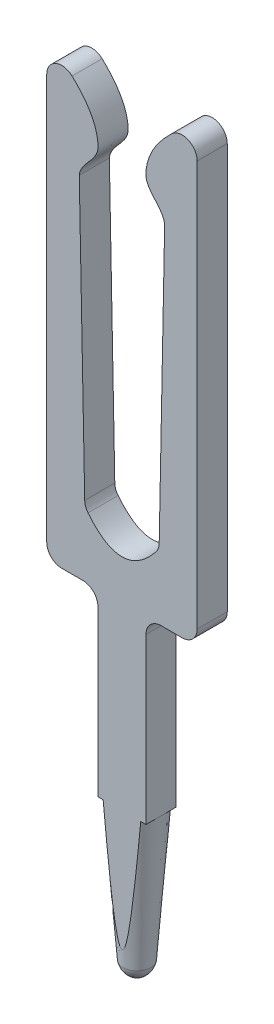
ISO-10303-21;
HEADER;
FILE_DESCRIPTION(('STEP AP214'),'2;1');
FILE_NAME('part.step','',(''),(''),'','','');
FILE_SCHEMA(('AUTOMOTIVE_DESIGN { 1 0 10303 214 1 1 1 1 }'));
ENDSEC;
DATA;
#1=APPLICATION_CONTEXT('core data for automotive mechanical design processes');
#2=APPLICATION_PROTOCOL_DEFINITION('international standard','automotive_design',2000,#1);
#3=PRODUCT_CONTEXT('',#1,'mechanical');
#4=PRODUCT('Part','Part','',(#3));
#5=PRODUCT_RELATED_PRODUCT_CATEGORY('part','',(#4));
#6=PRODUCT_DEFINITION_FORMATION('','',#4);
#7=PRODUCT_DEFINITION_CONTEXT('part definition',#1,'design');
#8=PRODUCT_DEFINITION('design','',#6,#7);
#9=PRODUCT_DEFINITION_SHAPE('','',#8);
#10=(LENGTH_UNIT() NAMED_UNIT(*) SI_UNIT(.MILLI.,.METRE.));
#11=(NAMED_UNIT(*) PLANE_ANGLE_UNIT() SI_UNIT($,.RADIAN.));
#12=(NAMED_UNIT(*) SI_UNIT($,.STERADIAN.) SOLID_ANGLE_UNIT());
#13=UNCERTAINTY_MEASURE_WITH_UNIT(LENGTH_MEASURE(1.E-05),#10,'distance_accuracy_value','');
#14=(GEOMETRIC_REPRESENTATION_CONTEXT(3) GLOBAL_UNCERTAINTY_ASSIGNED_CONTEXT((#13)) GLOBAL_UNIT_ASSIGNED_CONTEXT((#10,
#11,#12)) REPRESENTATION_CONTEXT('',''));
#15=CARTESIAN_POINT('',(0.,0.,0.));
#16=DIRECTION('',(0.,0.,1.));
#17=DIRECTION('',(1.,0.,0.));
#18=AXIS2_PLACEMENT_3D('',#15,#16,#17);
#19=CARTESIAN_POINT('',(0.0155617112013381,0.199393663752104,-0.2));
#20=DIRECTION('',(0.,0.,-1.));
#21=DIRECTION('',(-1.,0.,0.));
#22=AXIS2_PLACEMENT_3D('',#19,#20,#21);
#23=PLANE('',#22);
#24=DIRECTION('',(0.,1.,0.));
#25=VECTOR('',#24,1.);
#26=CARTESIAN_POINT('',(0.319999999997281,1.99939366375255,-0.2));
#27=LINE('',#26,#25);
#28=CARTESIAN_POINT('',(0.319999999997281,1.99939366375255,-0.2));
#29=VERTEX_POINT('',#28);
#30=CARTESIAN_POINT('',(0.3199999999973,4.18939366375255,-0.2));
#31=VERTEX_POINT('',#30);
#32=EDGE_CURVE('E289',#29,#31,#27,.T.);
#33=ORIENTED_EDGE('',*,*,#32,.F.);
#34=DIRECTION('',(-1.,0.,0.));
#35=VECTOR('',#34,1.);
#36=CARTESIAN_POINT('',(0.0155617112013381,1.99939366375255,-0.2));
#37=LINE('',#36,#35);
#38=CARTESIAN_POINT('',(0.249799919932453,1.99939366375255,-0.2));
#39=VERTEX_POINT('',#38);
#40=EDGE_CURVE('E401',#29,#39,#37,.T.);
#41=ORIENTED_EDGE('',*,*,#40,.T.);
#42=CARTESIAN_POINT('',(0.419073671509174,3.92408645516069,-0.2));
#43=CARTESIAN_POINT('',(0.40712800713045,3.78040321989385,-0.2));
#44=CARTESIAN_POINT('',(0.39509787611739,3.63672685641608,-0.2));
#45=CARTESIAN_POINT('',(0.370816830363134,3.34972510878114,-0.2));
#46=CARTESIAN_POINT('',(0.358566486072996,3.20639967630892,-0.2));
#47=CARTESIAN_POINT('',(0.333747204268376,2.91987142692738,-0.2));
#48=CARTESIAN_POINT('',(0.321178481879337,2.77666859142871,-0.2));
#49=CARTESIAN_POINT('',(0.295579302297555,2.49028337647282,-0.2));
#50=CARTESIAN_POINT('',(0.28254877963316,2.34710100282909,-0.2));
#51=CARTESIAN_POINT('',(0.255746692767626,2.06025946856469,-0.2));
#52=CARTESIAN_POINT('',(0.241972513289919,1.91660055184255,-0.2));
#53=CARTESIAN_POINT('',(0.21332051096251,1.62946663380266,-0.2));
#54=CARTESIAN_POINT('',(0.198443274298863,1.48599157543829,-0.2));
#55=CARTESIAN_POINT('',(0.174488103682482,1.27075833578245,-0.2));
#56=CARTESIAN_POINT('',(0.166217295950759,1.19891147184883,-0.2));
#57=CARTESIAN_POINT('',(0.153155496355246,1.09116578699053,-0.2));
#58=CARTESIAN_POINT('',(0.148688714349338,1.05522781017658,-0.2));
#59=CARTESIAN_POINT('',(0.139472101301677,0.983392587569458,-0.2));
#60=CARTESIAN_POINT('',(0.134722305843853,0.947495337231583,-0.2));
#61=CARTESIAN_POINT('',(0.124869569189077,0.875986870674893,-0.2));
#62=CARTESIAN_POINT('',(0.119769129267487,0.840375314140125,-0.2));
#63=CARTESIAN_POINT('',(0.109023940531379,0.769217978597621,-0.2));
#64=CARTESIAN_POINT('',(0.103378950954709,0.733672235832477,-0.2));
#65=CARTESIAN_POINT('',(0.0912261584756975,0.66280969959597,-0.2));
#66=CARTESIAN_POINT('',(0.084720471006859,0.627492560599039,-0.2));
#67=CARTESIAN_POINT('',(0.0701717985850192,0.557194005377,-0.2));
#68=CARTESIAN_POINT('',(0.0621295993725504,0.522212427114086,-0.2));
#69=CARTESIAN_POINT('',(0.0467760714276316,0.470439568704958,-0.2));
#70=CARTESIAN_POINT('',(0.0410923595049108,0.453258443601976,-0.2));
#71=CARTESIAN_POINT('',(0.0317678113762845,0.432730614051041,-0.2));
#72=CARTESIAN_POINT('',(0.0297864914459786,0.42866251065825,-0.2));
#73=CARTESIAN_POINT('',(0.0254404656816286,0.420718452882489,-0.2));
#74=CARTESIAN_POINT('',(0.0230756038515883,0.416842577524543,-0.2));
#75=CARTESIAN_POINT('',(0.0190242656789475,0.411372089797048,-0.2));
#76=CARTESIAN_POINT('',(0.0175825015592171,0.409598933684463,-0.2));
#77=CARTESIAN_POINT('',(0.0144628662287334,0.406276111920947,-0.2));
#78=CARTESIAN_POINT('',(0.012786408962071,0.404725212867752,-0.2));
#79=CARTESIAN_POINT('',(0.0101284893327938,0.402788969097241,-0.2));
#80=CARTESIAN_POINT('',(0.00927338341684285,0.402232411565888,-0.2));
#81=CARTESIAN_POINT('',(0.00749475933934107,0.401239035830602,-0.2));
#82=CARTESIAN_POINT('',(0.00657125356457239,0.400802196013568,-0.2));
#83=CARTESIAN_POINT('',(0.00464972682408425,0.40008322462344,-0.2));
#84=CARTESIAN_POINT('',(0.00365087233094683,0.39980324741838,-0.2));
#85=CARTESIAN_POINT('',(0.00161788992752478,0.39944672378717,-0.2));
#86=CARTESIAN_POINT('',(0.000583835507939093,0.399369777040811,-0.2));
#87=CARTESIAN_POINT('',(-0.00134496519590812,0.399426933555201,-0.2));
#88=CARTESIAN_POINT('',(-0.00224058550054397,0.399535259526285,-0.2));
#89=CARTESIAN_POINT('',(-0.00400090696380697,0.399901298855797,-0.2));
#90=CARTESIAN_POINT('',(-0.00486556903124924,0.400159194471305,-0.2));
#91=CARTESIAN_POINT('',(-0.00686482403314496,0.400919306230725,-0.2));
#92=CARTESIAN_POINT('',(-0.00797801607378553,0.401477011992304,-0.2));
#93=CARTESIAN_POINT('',(-0.0101045188725079,0.402757168379165,-0.2));
#94=CARTESIAN_POINT('',(-0.0111175704332691,0.403480031275694,-0.2));
#95=CARTESIAN_POINT('',(-0.0139133830459782,0.405726780073155,-0.2));
#96=CARTESIAN_POINT('',(-0.0155807703610358,0.407391946426814,-0.2));
#97=CARTESIAN_POINT('',(-0.0186820291032431,0.410925286642285,-0.2));
#98=CARTESIAN_POINT('',(-0.020115058046613,0.412794154340097,-0.2));
#99=CARTESIAN_POINT('',(-0.026352586066885,0.421636912065583,-0.2));
#100=CARTESIAN_POINT('',(-0.0302276290644721,0.429241265774938,-0.2));
#101=CARTESIAN_POINT('',(-0.0371989801361271,0.444788107661347,-0.2));
#102=CARTESIAN_POINT('',(-0.0402898393275208,0.452732536264918,-0.2));
#103=CARTESIAN_POINT('',(-0.0488029533433164,0.47660164451218,-0.2));
#104=CARTESIAN_POINT('',(-0.0535667068825664,0.492768378238746,-0.2));
#105=CARTESIAN_POINT('',(-0.0623134470368626,0.52531407131608,-0.2));
#106=CARTESIAN_POINT('',(-0.0662949805885245,0.541693366489904,-0.2));
#107=CARTESIAN_POINT('',(-0.0737505158343691,0.574526435078122,-0.2));
#108=CARTESIAN_POINT('',(-0.0772258035890998,0.590979906288539,-0.2));
#109=CARTESIAN_POINT('',(-0.0838389035205709,0.623937278303003,-0.2));
#110=CARTESIAN_POINT('',(-0.0869770063299774,0.640441122860909,-0.2));
#111=CARTESIAN_POINT('',(-0.102049532537044,0.72278018582763,-0.2));
#112=CARTESIAN_POINT('',(-0.112300603152623,0.788919708458034,-0.2));
#113=CARTESIAN_POINT('',(-0.13135461914938,0.921430874952234,-0.2));
#114=CARTESIAN_POINT('',(-0.140156603016787,0.987802643333006,-0.2));
#115=CARTESIAN_POINT('',(-0.156879631764283,1.12068310945857,-0.2));
#116=CARTESIAN_POINT('',(-0.164800364523363,1.18719184727427,-0.2));
#117=CARTESIAN_POINT('',(-0.180078981910539,1.3202538247986,-0.2));
#118=CARTESIAN_POINT('',(-0.187437019417306,1.38680704742866,-0.2));
#119=CARTESIAN_POINT('',(-0.205254538586591,1.55245287869218,-0.2));
#120=CARTESIAN_POINT('',(-0.215474723437725,1.65157125328146,-0.2));
#121=CARTESIAN_POINT('',(-0.23535301218604,1.84986455219131,-0.2));
#122=CARTESIAN_POINT('',(-0.245011110635313,1.94903947705058,-0.2));
#123=CARTESIAN_POINT('',(-0.273406067564648,2.24664341284771,-0.2));
#124=CARTESIAN_POINT('',(-0.291561130557218,2.44512780087954,-0.2));
#125=CARTESIAN_POINT('',(-0.327009406118385,2.84211156896891,-0.2));
#126=CARTESIAN_POINT('',(-0.344302878718391,3.0406109261725,-0.2));
#127=CARTESIAN_POINT('',(-0.378338654200096,3.43765003785158,-0.2));
#128=CARTESIAN_POINT('',(-0.395080975905226,3.63618979071395,-0.2));
#129=CARTESIAN_POINT('',(-0.414119776687289,3.86452514202617,-0.2));
#130=CARTESIAN_POINT('',(-0.416598673518151,3.89430563855745,-0.2));
#131=CARTESIAN_POINT('',(-0.419073671509174,3.92408645516069,-0.2));
#132=B_SPLINE_CURVE_WITH_KNOTS('',3,(#42,#43,#44,#45,#46,#47,#48,#49,#50,#51,#52,#53,#54,#55,
#56,#57,#58,#59,#60,#61,#62,#63,#64,#65,#66,#67,#68,#69,#70,#71,#72,#73,#74,#75,#76,#77,#78,#79,
#80,#81,#82,#83,#84,#85,#86,#87,#88,#89,#90,#91,#92,#93,#94,#95,#96,#97,#98,#99,#100,#101,#102,
#103,#104,#105,#106,#107,#108,#109,#110,#111,#112,#113,#114,#115,#116,#117,#118,#119,#120,#121,
#122,#123,#124,#125,#126,#127,#128,#129,#130,#131),.UNSPECIFIED.,.F.,.F.,(4,2,2,2,2,2,2,2,2,2,2,
2,2,2,2,2,2,2,2,2,2,2,2,2,2,2,2,2,2,2,2,2,2,2,2,2,2,2,2,2,2,2,2,2,4),(0.,0.432537071701733,
0.864080860612755,1.29534045243422,1.72666143254115,2.15961302404024,2.59233616332747,
2.80929644105702,2.9179390980667,3.02656812389335,3.13448971305868,3.24245923830052,
3.35016816070605,3.45782214969942,3.51190746769699,3.52547400696589,3.53904607798438,
3.5458913073511,3.55269694209812,3.55575075639856,3.55880401901837,3.56189824743552,
3.56498637031057,3.56767883282506,3.57037458313558,3.57408854250019,3.57781187608443,
3.58484167468291,3.59189621382303,3.61730638147686,3.64288855281723,3.69336733772496,
3.74393902408941,3.7943799103403,3.8447769648626,4.0455035147587,4.24636272074621,
4.44729284197419,4.64816817710812,4.94709671827265,5.24602815625899,5.84396276199637,
6.441715801739,7.0394484052259,7.12909886908129),.UNSPECIFIED.);
#133=CARTESIAN_POINT('',(-0.249799919932453,1.99939366375255,-0.2));
#134=VERTEX_POINT('',#133);
#135=EDGE_CURVE('E348',#39,#134,#132,.T.);
#136=ORIENTED_EDGE('',*,*,#135,.T.);
#137=CARTESIAN_POINT('',(-0.319999999997295,1.99939366375255,-0.2));
#138=VERTEX_POINT('',#137);
#139=EDGE_CURVE('E223',#134,#138,#37,.T.);
#140=ORIENTED_EDGE('',*,*,#139,.T.);
#141=DIRECTION('',(0.,-1.,0.));
#142=VECTOR('',#141,1.);
#143=CARTESIAN_POINT('',(-0.319999999997295,1.99939366375255,-0.2));
#144=LINE('',#143,#142);
#145=CARTESIAN_POINT('',(-0.319999999997299,4.18939366375255,-0.2));
#146=VERTEX_POINT('',#145);
#147=EDGE_CURVE('E214',#146,#138,#144,.T.);
#148=ORIENTED_EDGE('',*,*,#147,.F.);
#149=CARTESIAN_POINT('',(-0.519999999997295,4.18939366375255,-0.2));
#150=DIRECTION('',(0.,0.,-1.));
#151=DIRECTION('',(1.,0.,0.));
#152=AXIS2_PLACEMENT_3D('',#149,#150,#151);
#153=CIRCLE('',#152,0.199999999999995);
#154=CARTESIAN_POINT('',(-0.519999999997295,4.38939366375255,-0.2));
#155=VERTEX_POINT('',#154);
#156=EDGE_CURVE('E204',#155,#146,#153,.T.);
#157=ORIENTED_EDGE('',*,*,#156,.F.);
#158=DIRECTION('',(1.,0.,0.));
#159=VECTOR('',#158,1.);
#160=CARTESIAN_POINT('',(-0.519999999997295,4.38939366375255,-0.2));
#161=LINE('',#160,#159);
#162=CARTESIAN_POINT('',(-0.799999999997302,4.38939366375254,-0.2));
#163=VERTEX_POINT('',#162);
#164=EDGE_CURVE('E187',#163,#155,#161,.T.);
#165=ORIENTED_EDGE('',*,*,#164,.F.);
#166=CARTESIAN_POINT('',(-0.799999999997302,4.58939366375254,-0.2));
#167=DIRECTION('',(0.,0.,1.));
#168=DIRECTION('',(-1.,0.,0.));
#169=AXIS2_PLACEMENT_3D('',#166,#167,#168);
#170=CIRCLE('',#169,0.199999999999997);
#171=CARTESIAN_POINT('',(-0.999999999997299,4.58939366375254,-0.2));
#172=VERTEX_POINT('',#171);
#173=EDGE_CURVE('E202',#172,#163,#170,.T.);
#174=ORIENTED_EDGE('',*,*,#173,.F.);
#175=DIRECTION('',(0.,-1.,0.));
#176=VECTOR('',#175,1.);
#177=CARTESIAN_POINT('',(-0.999999999997301,4.58939366375254,-0.2));
#178=LINE('',#177,#176);
#179=CARTESIAN_POINT('',(-0.999999999997309,9.9798172007234,-0.2));
#180=VERTEX_POINT('',#179);
#181=EDGE_CURVE('E207',#180,#172,#178,.T.);
#182=ORIENTED_EDGE('',*,*,#181,.F.);
#183=CARTESIAN_POINT('',(-0.79999999999731,9.9798172007234,-0.2));
#184=DIRECTION('',(0.,0.,1.));
#185=DIRECTION('',(-1.,0.,0.));
#186=AXIS2_PLACEMENT_3D('',#183,#184,#185);
#187=CIRCLE('',#186,0.199999999999997);
#188=CARTESIAN_POINT('',(-0.663039519004162,10.1255629610258,-0.2));
#189=VERTEX_POINT('',#188);
#190=EDGE_CURVE('E209',#189,#180,#187,.T.);
#191=ORIENTED_EDGE('',*,*,#190,.F.);
#192=CARTESIAN_POINT('',(-0.56766920775558,9.0309634852231,-0.2));
#193=CARTESIAN_POINT('',(-0.548453887561713,9.19860321164783,-0.2));
#194=CARTESIAN_POINT('',(-0.310671132232241,9.31086590512073,-0.2));
#195=CARTESIAN_POINT('',(-0.326177603548476,9.73877355482184,-0.2));
#196=CARTESIAN_POINT('',(-0.487599251440385,9.9606979015953,-0.2));
#197=CARTESIAN_POINT('',(-0.663039519004169,10.1255629610258,-0.2));
#198=B_SPLINE_CURVE_WITH_KNOTS('',3,(#192,#193,#194,#195,#196,#197),.UNSPECIFIED.,.F.,.F.,(4,1,
1,4),(0.253308427317744,0.546240991694777,0.590136450844154,1.),.UNSPECIFIED.);
#199=CARTESIAN_POINT('',(-0.56766920775558,9.0309634852231,-0.2));
#200=VERTEX_POINT('',#199);
#201=EDGE_CURVE('E504',#200,#189,#198,.T.);
#202=ORIENTED_EDGE('',*,*,#201,.F.);
#203=DIRECTION('',(-0.0195430550508509,0.999809016262246,0.));
#204=VECTOR('',#203,1.);
#205=CARTESIAN_POINT('',(-0.567669207755583,9.0309634852231,-0.2));
#206=LINE('',#205,#204);
#207=CARTESIAN_POINT('',(-0.495215905001463,5.32430323363701,-0.2));
#208=VERTEX_POINT('',#207);
#209=EDGE_CURVE('E505',#208,#200,#206,.T.);
#210=ORIENTED_EDGE('',*,*,#209,.F.);
#211=CARTESIAN_POINT('',(-0.295254101749013,5.32821184464718,-0.2));
#212=DIRECTION('',(0.,0.,-1.));
#213=DIRECTION('',(1.,0.,0.));
#214=AXIS2_PLACEMENT_3D('',#211,#212,#213);
#215=CIRCLE('',#214,0.199999999999999);
#216=CARTESIAN_POINT('',(-0.45105383851106,5.20280673300943,-0.2));
#217=VERTEX_POINT('',#216);
#218=EDGE_CURVE('E540',#217,#208,#215,.T.);
#219=ORIENTED_EDGE('',*,*,#218,.F.);
#220=CARTESIAN_POINT('',(0.451053838511066,5.20280673300943,-0.2));
#221=CARTESIAN_POINT('',(0.,4.64243029868569,-0.2));
#222=CARTESIAN_POINT('',(-0.451053838511059,5.20280673300943,-0.2));
#223=B_SPLINE_CURVE_WITH_KNOTS('',2,(#220,#221,#222),.UNSPECIFIED.,.F.,.F.,(3,3),
(0.0434047342329982,0.956595265767001),.UNSPECIFIED.);
#224=CARTESIAN_POINT('',(0.451053838511066,5.20280673300943,-0.2));
#225=VERTEX_POINT('',#224);
#226=EDGE_CURVE('E535',#225,#217,#223,.T.);
#227=ORIENTED_EDGE('',*,*,#226,.F.);
#228=CARTESIAN_POINT('',(0.295254101749014,5.32821184464718,-0.2));
#229=DIRECTION('',(0.,0.,-1.));
#230=DIRECTION('',(-1.,0.,0.));
#231=AXIS2_PLACEMENT_3D('',#228,#229,#230);
#232=CIRCLE('',#231,0.200000000000008);
#233=CARTESIAN_POINT('',(0.495215905001471,5.32430323363701,-0.2));
#234=VERTEX_POINT('',#233);
#235=EDGE_CURVE('E541',#234,#225,#232,.T.);
#236=ORIENTED_EDGE('',*,*,#235,.F.);
#237=DIRECTION('',(-0.0195430550508509,-0.999809016262246,0.));
#238=VECTOR('',#237,1.);
#239=CARTESIAN_POINT('',(0.56766920775559,9.0309634852231,-0.2));
#240=LINE('',#239,#238);
#241=CARTESIAN_POINT('',(0.56766920775559,9.0309634852231,-0.2));
#242=VERTEX_POINT('',#241);
#243=EDGE_CURVE('E433',#242,#234,#240,.T.);
#244=ORIENTED_EDGE('',*,*,#243,.F.);
#245=CARTESIAN_POINT('',(0.663039519004167,10.1255629610258,-0.2));
#246=CARTESIAN_POINT('',(0.487599251440384,9.9606979015953,-0.2));
#247=CARTESIAN_POINT('',(0.326177603548475,9.73877355482184,-0.2));
#248=CARTESIAN_POINT('',(0.310671132232241,9.31086590512075,-0.2));
#249=CARTESIAN_POINT('',(0.548453887561712,9.19860321164784,-0.2));
#250=CARTESIAN_POINT('',(0.56766920775558,9.0309634852231,-0.2));
#251=B_SPLINE_CURVE_WITH_KNOTS('',3,(#245,#246,#247,#248,#249,#250),.UNSPECIFIED.,.F.,.F.,(4,1,
1,4),(0.253308427317744,0.66317197647359,0.707067435622967,1.),.UNSPECIFIED.);
#252=CARTESIAN_POINT('',(0.663039519004167,10.1255629610258,-0.2));
#253=VERTEX_POINT('',#252);
#254=EDGE_CURVE('E427',#253,#242,#251,.T.);
#255=ORIENTED_EDGE('',*,*,#254,.F.);
#256=CARTESIAN_POINT('',(0.799999999997309,9.9798172007234,-0.2));
#257=DIRECTION('',(0.,0.,1.));
#258=DIRECTION('',(1.,0.,0.));
#259=AXIS2_PLACEMENT_3D('',#256,#257,#258);
#260=CIRCLE('',#259,0.199999999999997);
#261=CARTESIAN_POINT('',(0.999999999997306,9.9798172007234,-0.2));
#262=VERTEX_POINT('',#261);
#263=EDGE_CURVE('E424',#262,#253,#260,.T.);
#264=ORIENTED_EDGE('',*,*,#263,.F.);
#265=DIRECTION('',(0.,1.,0.));
#266=VECTOR('',#265,1.);
#267=CARTESIAN_POINT('',(0.999999999997302,4.58939366375254,-0.2));
#268=LINE('',#267,#266);
#269=CARTESIAN_POINT('',(0.999999999997302,4.58939366375254,-0.2));
#270=VERTEX_POINT('',#269);
#271=EDGE_CURVE('E421',#270,#262,#268,.T.);
#272=ORIENTED_EDGE('',*,*,#271,.F.);
#273=CARTESIAN_POINT('',(0.799999999997303,4.58939366375254,-0.2));
#274=DIRECTION('',(0.,0.,1.));
#275=DIRECTION('',(1.,0.,0.));
#276=AXIS2_PLACEMENT_3D('',#273,#274,#275);
#277=CIRCLE('',#276,0.199999999999997);
#278=CARTESIAN_POINT('',(0.799999999997303,4.38939366375254,-0.2));
#279=VERTEX_POINT('',#278);
#280=EDGE_CURVE('E418',#279,#270,#277,.T.);
#281=ORIENTED_EDGE('',*,*,#280,.F.);
#282=DIRECTION('',(1.,0.,0.));
#283=VECTOR('',#282,1.);
#284=CARTESIAN_POINT('',(0.519999999997295,4.38939366375255,-0.2));
#285=LINE('',#284,#283);
#286=CARTESIAN_POINT('',(0.519999999997295,4.38939366375255,-0.2));
#287=VERTEX_POINT('',#286);
#288=EDGE_CURVE('E415',#287,#279,#285,.T.);
#289=ORIENTED_EDGE('',*,*,#288,.F.);
#290=CARTESIAN_POINT('',(0.519999999997295,4.18939366375255,-0.2));
#291=DIRECTION('',(0.,0.,-1.));
#292=DIRECTION('',(-1.,0.,0.));
#293=AXIS2_PLACEMENT_3D('',#290,#291,#292);
#294=CIRCLE('',#293,0.199999999999995);
#295=EDGE_CURVE('E413',#31,#287,#294,.T.);
#296=ORIENTED_EDGE('',*,*,#295,.F.);
#297=EDGE_LOOP('',(#33,#41,#136,#140,#148,#157,#165,#174,#182,#191,#202,#210,#219,#227,#236,
#244,#255,#264,#272,#281,#289,#296));
#298=FACE_BOUND('',#297,.T.);
#299=ADVANCED_FACE('F39',(#298),#23,.T.);
#300=CARTESIAN_POINT('',(0.0155617112013381,0.199393663752104,0.2));
#301=DIRECTION('',(0.,0.,-1.));
#302=DIRECTION('',(-1.,0.,0.));
#303=AXIS2_PLACEMENT_3D('',#300,#301,#302);
#304=PLANE('',#303);
#305=DIRECTION('',(-1.,0.,0.));
#306=VECTOR('',#305,1.);
#307=CARTESIAN_POINT('',(0.0155617112013381,1.99939366375255,0.2));
#308=LINE('',#307,#306);
#309=CARTESIAN_POINT('',(0.31999999999729,1.99939366375255,0.2));
#310=VERTEX_POINT('',#309);
#311=CARTESIAN_POINT('',(0.249799919932453,1.99939366375255,0.2));
#312=VERTEX_POINT('',#311);
#313=EDGE_CURVE('E11',#310,#312,#308,.T.);
#314=ORIENTED_EDGE('',*,*,#313,.F.);
#315=DIRECTION('',(0.,1.,0.));
#316=VECTOR('',#315,1.);
#317=CARTESIAN_POINT('',(0.319999999997281,1.99939366375255,0.2));
#318=LINE('',#317,#316);
#319=CARTESIAN_POINT('',(0.3199999999973,4.18939366375255,0.2));
#320=VERTEX_POINT('',#319);
#321=EDGE_CURVE('E218',#310,#320,#318,.T.);
#322=ORIENTED_EDGE('',*,*,#321,.T.);
#323=CARTESIAN_POINT('',(0.519999999997295,4.18939366375255,0.2));
#324=DIRECTION('',(0.,0.,-1.));
#325=DIRECTION('',(-1.,0.,0.));
#326=AXIS2_PLACEMENT_3D('',#323,#324,#325);
#327=CIRCLE('',#326,0.199999999999995);
#328=CARTESIAN_POINT('',(0.519999999997295,4.38939366375255,0.2));
#329=VERTEX_POINT('',#328);
#330=EDGE_CURVE('E222',#320,#329,#327,.T.);
#331=ORIENTED_EDGE('',*,*,#330,.T.);
#332=DIRECTION('',(1.,0.,0.));
#333=VECTOR('',#332,1.);
#334=CARTESIAN_POINT('',(0.519999999997295,4.38939366375255,0.2));
#335=LINE('',#334,#333);
#336=CARTESIAN_POINT('',(0.799999999997303,4.38939366375254,0.2));
#337=VERTEX_POINT('',#336);
#338=EDGE_CURVE('E226',#329,#337,#335,.T.);
#339=ORIENTED_EDGE('',*,*,#338,.T.);
#340=CARTESIAN_POINT('',(0.799999999997303,4.58939366375254,0.2));
#341=DIRECTION('',(0.,0.,1.));
#342=DIRECTION('',(1.,0.,0.));
#343=AXIS2_PLACEMENT_3D('',#340,#341,#342);
#344=CIRCLE('',#343,0.199999999999997);
#345=CARTESIAN_POINT('',(0.999999999997302,4.58939366375254,0.2));
#346=VERTEX_POINT('',#345);
#347=EDGE_CURVE('E229',#337,#346,#344,.T.);
#348=ORIENTED_EDGE('',*,*,#347,.T.);
#349=DIRECTION('',(0.,1.,0.));
#350=VECTOR('',#349,1.);
#351=CARTESIAN_POINT('',(0.999999999997302,4.58939366375254,0.2));
#352=LINE('',#351,#350);
#353=CARTESIAN_POINT('',(0.999999999997306,9.9798172007234,0.2));
#354=VERTEX_POINT('',#353);
#355=EDGE_CURVE('E232',#346,#354,#352,.T.);
#356=ORIENTED_EDGE('',*,*,#355,.T.);
#357=CARTESIAN_POINT('',(0.799999999997309,9.9798172007234,0.2));
#358=DIRECTION('',(0.,0.,1.));
#359=DIRECTION('',(1.,0.,0.));
#360=AXIS2_PLACEMENT_3D('',#357,#358,#359);
#361=CIRCLE('',#360,0.199999999999997);
#362=CARTESIAN_POINT('',(0.663039519004167,10.1255629610258,0.2));
#363=VERTEX_POINT('',#362);
#364=EDGE_CURVE('E235',#354,#363,#361,.T.);
#365=ORIENTED_EDGE('',*,*,#364,.T.);
#366=CARTESIAN_POINT('',(0.663039519004167,10.1255629610258,0.2));
#367=CARTESIAN_POINT('',(0.487599251440384,9.9606979015953,0.2));
#368=CARTESIAN_POINT('',(0.326177603548475,9.73877355482184,0.2));
#369=CARTESIAN_POINT('',(0.310671132232241,9.31086590512075,0.2));
#370=CARTESIAN_POINT('',(0.548453887561712,9.19860321164784,0.2));
#371=CARTESIAN_POINT('',(0.56766920775558,9.0309634852231,0.2));
#372=B_SPLINE_CURVE_WITH_KNOTS('',3,(#366,#367,#368,#369,#370,#371),.UNSPECIFIED.,.F.,.F.,(4,1,
1,4),(0.253308427317744,0.66317197647359,0.707067435622967,1.),.UNSPECIFIED.);
#373=CARTESIAN_POINT('',(0.56766920775559,9.0309634852231,0.2));
#374=VERTEX_POINT('',#373);
#375=EDGE_CURVE('E238',#363,#374,#372,.T.);
#376=ORIENTED_EDGE('',*,*,#375,.T.);
#377=DIRECTION('',(-0.0195430550508509,-0.999809016262246,0.));
#378=VECTOR('',#377,1.);
#379=CARTESIAN_POINT('',(0.56766920775559,9.0309634852231,0.2));
#380=LINE('',#379,#378);
#381=CARTESIAN_POINT('',(0.495215905001471,5.32430323363701,0.2));
#382=VERTEX_POINT('',#381);
#383=EDGE_CURVE('E243',#374,#382,#380,.T.);
#384=ORIENTED_EDGE('',*,*,#383,.T.);
#385=CARTESIAN_POINT('',(0.295254101749014,5.32821184464718,0.2));
#386=DIRECTION('',(0.,0.,-1.));
#387=DIRECTION('',(-1.,0.,0.));
#388=AXIS2_PLACEMENT_3D('',#385,#386,#387);
#389=CIRCLE('',#388,0.200000000000008);
#390=CARTESIAN_POINT('',(0.451053838511066,5.20280673300943,0.2));
#391=VERTEX_POINT('',#390);
#392=EDGE_CURVE('E249',#382,#391,#389,.T.);
#393=ORIENTED_EDGE('',*,*,#392,.T.);
#394=CARTESIAN_POINT('',(0.451053838511066,5.20280673300943,0.2));
#395=CARTESIAN_POINT('',(0.,4.64243029868569,0.2));
#396=CARTESIAN_POINT('',(-0.451053838511059,5.20280673300943,0.2));
#397=B_SPLINE_CURVE_WITH_KNOTS('',2,(#394,#395,#396),.UNSPECIFIED.,.F.,.F.,(3,3),
(0.0434047342329982,0.956595265767001),.UNSPECIFIED.);
#398=CARTESIAN_POINT('',(-0.45105383851106,5.20280673300943,0.2));
#399=VERTEX_POINT('',#398);
#400=EDGE_CURVE('E252',#391,#399,#397,.T.);
#401=ORIENTED_EDGE('',*,*,#400,.T.);
#402=CARTESIAN_POINT('',(-0.295254101749013,5.32821184464718,0.2));
#403=DIRECTION('',(0.,0.,-1.));
#404=DIRECTION('',(1.,0.,0.));
#405=AXIS2_PLACEMENT_3D('',#402,#403,#404);
#406=CIRCLE('',#405,0.199999999999999);
#407=CARTESIAN_POINT('',(-0.495215905001463,5.32430323363701,0.2));
#408=VERTEX_POINT('',#407);
#409=EDGE_CURVE('E257',#399,#408,#406,.T.);
#410=ORIENTED_EDGE('',*,*,#409,.T.);
#411=DIRECTION('',(-0.0195430550508509,0.999809016262246,0.));
#412=VECTOR('',#411,1.);
#413=CARTESIAN_POINT('',(-0.567669207755583,9.0309634852231,0.2));
#414=LINE('',#413,#412);
#415=CARTESIAN_POINT('',(-0.56766920775558,9.0309634852231,0.2));
#416=VERTEX_POINT('',#415);
#417=EDGE_CURVE('E263',#408,#416,#414,.T.);
#418=ORIENTED_EDGE('',*,*,#417,.T.);
#419=CARTESIAN_POINT('',(-0.56766920775558,9.0309634852231,0.2));
#420=CARTESIAN_POINT('',(-0.548453887561713,9.19860321164783,0.2));
#421=CARTESIAN_POINT('',(-0.310671132232241,9.31086590512073,0.2));
#422=CARTESIAN_POINT('',(-0.326177603548476,9.73877355482184,0.2));
#423=CARTESIAN_POINT('',(-0.487599251440385,9.9606979015953,0.2));
#424=CARTESIAN_POINT('',(-0.663039519004169,10.1255629610258,0.2));
#425=B_SPLINE_CURVE_WITH_KNOTS('',3,(#419,#420,#421,#422,#423,#424),.UNSPECIFIED.,.F.,.F.,(4,1,
1,4),(0.253308427317744,0.546240991694777,0.590136450844154,1.),.UNSPECIFIED.);
#426=CARTESIAN_POINT('',(-0.663039519004162,10.1255629610258,0.2));
#427=VERTEX_POINT('',#426);
#428=EDGE_CURVE('E266',#416,#427,#425,.T.);
#429=ORIENTED_EDGE('',*,*,#428,.T.);
#430=CARTESIAN_POINT('',(-0.79999999999731,9.9798172007234,0.2));
#431=DIRECTION('',(0.,0.,1.));
#432=DIRECTION('',(-1.,0.,0.));
#433=AXIS2_PLACEMENT_3D('',#430,#431,#432);
#434=CIRCLE('',#433,0.199999999999997);
#435=CARTESIAN_POINT('',(-0.999999999997309,9.9798172007234,0.2));
#436=VERTEX_POINT('',#435);
#437=EDGE_CURVE('E271',#427,#436,#434,.T.);
#438=ORIENTED_EDGE('',*,*,#437,.T.);
#439=DIRECTION('',(0.,-1.,0.));
#440=VECTOR('',#439,1.);
#441=CARTESIAN_POINT('',(-0.999999999997301,4.58939366375254,0.2));
#442=LINE('',#441,#440);
#443=CARTESIAN_POINT('',(-0.999999999997299,4.58939366375254,0.2));
#444=VERTEX_POINT('',#443);
#445=EDGE_CURVE('E277',#436,#444,#442,.T.);
#446=ORIENTED_EDGE('',*,*,#445,.T.);
#447=CARTESIAN_POINT('',(-0.799999999997302,4.58939366375254,0.2));
#448=DIRECTION('',(0.,0.,1.));
#449=DIRECTION('',(-1.,0.,0.));
#450=AXIS2_PLACEMENT_3D('',#447,#448,#449);
#451=CIRCLE('',#450,0.199999999999997);
#452=CARTESIAN_POINT('',(-0.799999999997302,4.38939366375254,0.2));
#453=VERTEX_POINT('',#452);
#454=EDGE_CURVE('E280',#444,#453,#451,.T.);
#455=ORIENTED_EDGE('',*,*,#454,.T.);
#456=DIRECTION('',(1.,0.,0.));
#457=VECTOR('',#456,1.);
#458=CARTESIAN_POINT('',(-0.519999999997295,4.38939366375255,0.2));
#459=LINE('',#458,#457);
#460=CARTESIAN_POINT('',(-0.519999999997295,4.38939366375255,0.2));
#461=VERTEX_POINT('',#460);
#462=EDGE_CURVE('E189',#453,#461,#459,.T.);
#463=ORIENTED_EDGE('',*,*,#462,.T.);
#464=CARTESIAN_POINT('',(-0.519999999997295,4.18939366375255,0.2));
#465=DIRECTION('',(0.,0.,-1.));
#466=DIRECTION('',(1.,0.,0.));
#467=AXIS2_PLACEMENT_3D('',#464,#465,#466);
#468=CIRCLE('',#467,0.199999999999995);
#469=CARTESIAN_POINT('',(-0.319999999997299,4.18939366375255,0.2));
#470=VERTEX_POINT('',#469);
#471=EDGE_CURVE('E283',#461,#470,#468,.T.);
#472=ORIENTED_EDGE('',*,*,#471,.T.);
#473=DIRECTION('',(0.,-1.,0.));
#474=VECTOR('',#473,1.);
#475=CARTESIAN_POINT('',(-0.319999999997295,1.99939366375255,0.2));
#476=LINE('',#475,#474);
#477=CARTESIAN_POINT('',(-0.319999999997295,1.99939366375255,0.2));
#478=VERTEX_POINT('',#477);
#479=EDGE_CURVE('E286',#470,#478,#476,.T.);
#480=ORIENTED_EDGE('',*,*,#479,.T.);
#481=CARTESIAN_POINT('',(-0.249799919932453,1.99939366375255,0.2));
#482=VERTEX_POINT('',#481);
#483=EDGE_CURVE('E43',#482,#478,#308,.T.);
#484=ORIENTED_EDGE('',*,*,#483,.F.);
#485=CARTESIAN_POINT('',(0.419073671509174,3.92408645516069,0.2));
#486=CARTESIAN_POINT('',(0.40712800713045,3.78040321989385,0.2));
#487=CARTESIAN_POINT('',(0.39509787611739,3.63672685641608,0.2));
#488=CARTESIAN_POINT('',(0.370816830363134,3.34972510878114,0.2));
#489=CARTESIAN_POINT('',(0.358566486072996,3.20639967630892,0.2));
#490=CARTESIAN_POINT('',(0.333747204268376,2.91987142692738,0.2));
#491=CARTESIAN_POINT('',(0.321178481879337,2.77666859142871,0.2));
#492=CARTESIAN_POINT('',(0.295579302297555,2.49028337647282,0.2));
#493=CARTESIAN_POINT('',(0.28254877963316,2.34710100282909,0.2));
#494=CARTESIAN_POINT('',(0.255746692767626,2.06025946856469,0.2));
#495=CARTESIAN_POINT('',(0.241972513289919,1.91660055184255,0.2));
#496=CARTESIAN_POINT('',(0.21332051096251,1.62946663380266,0.2));
#497=CARTESIAN_POINT('',(0.198443274298863,1.48599157543829,0.2));
#498=CARTESIAN_POINT('',(0.174488103682482,1.27075833578245,0.2));
#499=CARTESIAN_POINT('',(0.166217295950759,1.19891147184883,0.2));
#500=CARTESIAN_POINT('',(0.153155496355246,1.09116578699053,0.2));
#501=CARTESIAN_POINT('',(0.148688714349338,1.05522781017658,0.2));
#502=CARTESIAN_POINT('',(0.139472101301677,0.983392587569458,0.2));
#503=CARTESIAN_POINT('',(0.134722305843853,0.947495337231583,0.2));
#504=CARTESIAN_POINT('',(0.124869569189077,0.875986870674893,0.2));
#505=CARTESIAN_POINT('',(0.119769129267487,0.840375314140125,0.2));
#506=CARTESIAN_POINT('',(0.109023940531379,0.769217978597621,0.2));
#507=CARTESIAN_POINT('',(0.103378950954709,0.733672235832477,0.2));
#508=CARTESIAN_POINT('',(0.0912261584756975,0.66280969959597,0.2));
#509=CARTESIAN_POINT('',(0.084720471006859,0.627492560599039,0.2));
#510=CARTESIAN_POINT('',(0.0701717985850192,0.557194005377,0.2));
#511=CARTESIAN_POINT('',(0.0621295993725504,0.522212427114086,0.2));
#512=CARTESIAN_POINT('',(0.0467760714276316,0.470439568704958,0.2));
#513=CARTESIAN_POINT('',(0.0410923595049108,0.453258443601976,0.2));
#514=CARTESIAN_POINT('',(0.0317678113762845,0.432730614051041,0.2));
#515=CARTESIAN_POINT('',(0.0297864914459786,0.42866251065825,0.2));
#516=CARTESIAN_POINT('',(0.0254404656816286,0.420718452882489,0.2));
#517=CARTESIAN_POINT('',(0.0230756038515883,0.416842577524543,0.2));
#518=CARTESIAN_POINT('',(0.0190242656789475,0.411372089797048,0.2));
#519=CARTESIAN_POINT('',(0.0175825015592171,0.409598933684463,0.2));
#520=CARTESIAN_POINT('',(0.0144628662287334,0.406276111920947,0.2));
#521=CARTESIAN_POINT('',(0.012786408962071,0.404725212867752,0.2));
#522=CARTESIAN_POINT('',(0.0101284893327938,0.402788969097241,0.2));
#523=CARTESIAN_POINT('',(0.00927338341684285,0.402232411565888,0.2));
#524=CARTESIAN_POINT('',(0.00749475933934107,0.401239035830602,0.2));
#525=CARTESIAN_POINT('',(0.00657125356457239,0.400802196013568,0.2));
#526=CARTESIAN_POINT('',(0.00464972682408425,0.40008322462344,0.2));
#527=CARTESIAN_POINT('',(0.00365087233094683,0.39980324741838,0.2));
#528=CARTESIAN_POINT('',(0.00161788992752478,0.39944672378717,0.2));
#529=CARTESIAN_POINT('',(0.000583835507939093,0.399369777040811,0.2));
#530=CARTESIAN_POINT('',(-0.00134496519590812,0.399426933555201,0.2));
#531=CARTESIAN_POINT('',(-0.00224058550054397,0.399535259526285,0.2));
#532=CARTESIAN_POINT('',(-0.00400090696380697,0.399901298855797,0.2));
#533=CARTESIAN_POINT('',(-0.00486556903124924,0.400159194471305,0.2));
#534=CARTESIAN_POINT('',(-0.00686482403314496,0.400919306230725,0.2));
#535=CARTESIAN_POINT('',(-0.00797801607378553,0.401477011992304,0.2));
#536=CARTESIAN_POINT('',(-0.0101045188725079,0.402757168379165,0.2));
#537=CARTESIAN_POINT('',(-0.0111175704332691,0.403480031275694,0.2));
#538=CARTESIAN_POINT('',(-0.0139133830459782,0.405726780073155,0.2));
#539=CARTESIAN_POINT('',(-0.0155807703610358,0.407391946426814,0.2));
#540=CARTESIAN_POINT('',(-0.0186820291032431,0.410925286642285,0.2));
#541=CARTESIAN_POINT('',(-0.020115058046613,0.412794154340097,0.2));
#542=CARTESIAN_POINT('',(-0.026352586066885,0.421636912065583,0.2));
#543=CARTESIAN_POINT('',(-0.0302276290644721,0.429241265774938,0.2));
#544=CARTESIAN_POINT('',(-0.0371989801361271,0.444788107661347,0.2));
#545=CARTESIAN_POINT('',(-0.0402898393275208,0.452732536264918,0.2));
#546=CARTESIAN_POINT('',(-0.0488029533433164,0.47660164451218,0.2));
#547=CARTESIAN_POINT('',(-0.0535667068825664,0.492768378238746,0.2));
#548=CARTESIAN_POINT('',(-0.0623134470368626,0.52531407131608,0.2));
#549=CARTESIAN_POINT('',(-0.0662949805885245,0.541693366489904,0.2));
#550=CARTESIAN_POINT('',(-0.0737505158343691,0.574526435078122,0.2));
#551=CARTESIAN_POINT('',(-0.0772258035890998,0.590979906288539,0.2));
#552=CARTESIAN_POINT('',(-0.0838389035205709,0.623937278303003,0.2));
#553=CARTESIAN_POINT('',(-0.0869770063299774,0.640441122860909,0.2));
#554=CARTESIAN_POINT('',(-0.102049532537044,0.72278018582763,0.2));
#555=CARTESIAN_POINT('',(-0.112300603152623,0.788919708458034,0.2));
#556=CARTESIAN_POINT('',(-0.13135461914938,0.921430874952234,0.2));
#557=CARTESIAN_POINT('',(-0.140156603016787,0.987802643333006,0.2));
#558=CARTESIAN_POINT('',(-0.156879631764283,1.12068310945857,0.2));
#559=CARTESIAN_POINT('',(-0.164800364523363,1.18719184727427,0.2));
#560=CARTESIAN_POINT('',(-0.180078981910539,1.3202538247986,0.2));
#561=CARTESIAN_POINT('',(-0.187437019417306,1.38680704742866,0.2));
#562=CARTESIAN_POINT('',(-0.205254538586591,1.55245287869218,0.2));
#563=CARTESIAN_POINT('',(-0.215474723437725,1.65157125328146,0.2));
#564=CARTESIAN_POINT('',(-0.23535301218604,1.84986455219131,0.2));
#565=CARTESIAN_POINT('',(-0.245011110635313,1.94903947705058,0.2));
#566=CARTESIAN_POINT('',(-0.273406067564648,2.24664341284771,0.2));
#567=CARTESIAN_POINT('',(-0.291561130557218,2.44512780087954,0.2));
#568=CARTESIAN_POINT('',(-0.327009406118385,2.84211156896891,0.2));
#569=CARTESIAN_POINT('',(-0.344302878718391,3.0406109261725,0.2));
#570=CARTESIAN_POINT('',(-0.378338654200096,3.43765003785158,0.2));
#571=CARTESIAN_POINT('',(-0.395080975905226,3.63618979071395,0.2));
#572=CARTESIAN_POINT('',(-0.414119776687289,3.86452514202617,0.2));
#573=CARTESIAN_POINT('',(-0.416598673518151,3.89430563855745,0.2));
#574=CARTESIAN_POINT('',(-0.419073671509174,3.92408645516069,0.2));
#575=B_SPLINE_CURVE_WITH_KNOTS('',3,(#485,#486,#487,#488,#489,#490,#491,#492,#493,#494,#495,
#496,#497,#498,#499,#500,#501,#502,#503,#504,#505,#506,#507,#508,#509,#510,#511,#512,#513,#514,
#515,#516,#517,#518,#519,#520,#521,#522,#523,#524,#525,#526,#527,#528,#529,#530,#531,#532,#533,
#534,#535,#536,#537,#538,#539,#540,#541,#542,#543,#544,#545,#546,#547,#548,#549,#550,#551,#552,
#553,#554,#555,#556,#557,#558,#559,#560,#561,#562,#563,#564,#565,#566,#567,#568,#569,#570,#571,
#572,#573,#574),.UNSPECIFIED.,.F.,.F.,(4,2,2,2,2,2,2,2,2,2,2,2,2,2,2,2,2,2,2,2,2,2,2,2,2,2,2,2,
2,2,2,2,2,2,2,2,2,2,2,2,2,2,2,2,4),(0.,0.432537071701733,0.864080860612755,1.29534045243422,
1.72666143254115,2.15961302404024,2.59233616332747,2.80929644105702,2.9179390980667,
3.02656812389335,3.13448971305868,3.24245923830052,3.35016816070605,3.45782214969942,
3.51190746769699,3.52547400696589,3.53904607798438,3.5458913073511,3.55269694209812,
3.55575075639856,3.55880401901837,3.56189824743552,3.56498637031057,3.56767883282506,
3.57037458313558,3.57408854250019,3.57781187608443,3.58484167468291,3.59189621382303,
3.61730638147686,3.64288855281723,3.69336733772496,3.74393902408941,3.7943799103403,
3.8447769648626,4.0455035147587,4.24636272074621,4.44729284197419,4.64816817710812,
4.94709671827265,5.24602815625899,5.84396276199637,6.441715801739,7.0394484052259,
7.12909886908129),.UNSPECIFIED.);
#576=EDGE_CURVE('E294',#312,#482,#575,.T.);
#577=ORIENTED_EDGE('',*,*,#576,.F.);
#578=EDGE_LOOP('',(#314,#322,#331,#339,#348,#356,#365,#376,#384,#393,#401,#410,#418,#429,#438,
#446,#455,#463,#472,#480,#484,#577));
#579=FACE_BOUND('',#578,.T.);
#580=ADVANCED_FACE('F334',(#579),#304,.F.);
#581=CARTESIAN_POINT('',(-0.319999999997295,1.99939366375255,-0.2));
#582=DIRECTION('',(-1.,0.,0.));
#583=DIRECTION('',(0.,-1.,0.));
#584=AXIS2_PLACEMENT_3D('',#581,#582,#583);
#585=PLANE('',#584);
#586=ORIENTED_EDGE('',*,*,#479,.F.);
#587=DIRECTION('',(0.,0.,1.));
#588=VECTOR('',#587,1.);
#589=CARTESIAN_POINT('',(-0.319999999997299,4.18939366375255,-0.2));
#590=LINE('',#589,#588);
#591=EDGE_CURVE('E66',#146,#470,#590,.T.);
#592=ORIENTED_EDGE('',*,*,#591,.F.);
#593=ORIENTED_EDGE('',*,*,#147,.T.);
#594=DIRECTION('',(0.,0.,1.));
#595=VECTOR('',#594,1.);
#596=CARTESIAN_POINT('',(-0.319999999997295,1.99939366375255,-0.2));
#597=LINE('',#596,#595);
#598=CARTESIAN_POINT('',(-0.319999999997281,1.99939366375255,6.42895840269991E-12));
#599=VERTEX_POINT('',#598);
#600=EDGE_CURVE('E290',#138,#599,#597,.T.);
#601=ORIENTED_EDGE('',*,*,#600,.T.);
#602=DIRECTION('',(0.,0.,1.));
#603=VECTOR('',#602,1.);
#604=CARTESIAN_POINT('',(-0.319999999997295,1.99939366375255,-0.2));
#605=LINE('',#604,#603);
#606=EDGE_CURVE('E357',#599,#478,#605,.T.);
#607=ORIENTED_EDGE('',*,*,#606,.T.);
#608=EDGE_LOOP('',(#586,#592,#593,#601,#607));
#609=FACE_BOUND('',#608,.T.);
#610=ADVANCED_FACE('F492',(#609),#585,.T.);
#611=CARTESIAN_POINT('',(-0.519999999997295,4.18939366375255,-0.2));
#612=DIRECTION('',(0.,0.,1.));
#613=DIRECTION('',(1.,0.,0.));
#614=AXIS2_PLACEMENT_3D('',#611,#612,#613);
#615=CYLINDRICAL_SURFACE('',#614,0.199999999999995);
#616=ORIENTED_EDGE('',*,*,#471,.F.);
#617=DIRECTION('',(0.,0.,1.));
#618=VECTOR('',#617,1.);
#619=CARTESIAN_POINT('',(-0.519999999997295,4.38939366375255,-0.2));
#620=LINE('',#619,#618);
#621=EDGE_CURVE('E194',#155,#461,#620,.T.);
#622=ORIENTED_EDGE('',*,*,#621,.F.);
#623=ORIENTED_EDGE('',*,*,#156,.T.);
#624=ORIENTED_EDGE('',*,*,#591,.T.);
#625=EDGE_LOOP('',(#616,#622,#623,#624));
#626=FACE_BOUND('',#625,.T.);
#627=ADVANCED_FACE('F493',(#626),#615,.F.);
#628=CARTESIAN_POINT('',(-0.519999999997295,4.38939366375255,-0.2));
#629=DIRECTION('',(0.,-1.,0.));
#630=DIRECTION('',(1.,0.,0.));
#631=AXIS2_PLACEMENT_3D('',#628,#629,#630);
#632=PLANE('',#631);
#633=ORIENTED_EDGE('',*,*,#462,.F.);
#634=DIRECTION('',(0.,0.,1.));
#635=VECTOR('',#634,1.);
#636=CARTESIAN_POINT('',(-0.799999999997302,4.38939366375254,-0.2));
#637=LINE('',#636,#635);
#638=EDGE_CURVE('E184',#163,#453,#637,.T.);
#639=ORIENTED_EDGE('',*,*,#638,.F.);
#640=ORIENTED_EDGE('',*,*,#164,.T.);
#641=ORIENTED_EDGE('',*,*,#621,.T.);
#642=EDGE_LOOP('',(#633,#639,#640,#641));
#643=FACE_BOUND('',#642,.T.);
#644=ADVANCED_FACE('F186',(#643),#632,.T.);
#645=CARTESIAN_POINT('',(-0.799999999997302,4.58939366375254,-0.2));
#646=DIRECTION('',(0.,0.,1.));
#647=DIRECTION('',(1.,0.,0.));
#648=AXIS2_PLACEMENT_3D('',#645,#646,#647);
#649=CYLINDRICAL_SURFACE('',#648,0.199999999999997);
#650=ORIENTED_EDGE('',*,*,#454,.F.);
#651=DIRECTION('',(0.,0.,1.));
#652=VECTOR('',#651,1.);
#653=CARTESIAN_POINT('',(-0.999999999997299,4.58939366375254,-0.2));
#654=LINE('',#653,#652);
#655=EDGE_CURVE('E195',#172,#444,#654,.T.);
#656=ORIENTED_EDGE('',*,*,#655,.F.);
#657=ORIENTED_EDGE('',*,*,#173,.T.);
#658=ORIENTED_EDGE('',*,*,#638,.T.);
#659=EDGE_LOOP('',(#650,#656,#657,#658));
#660=FACE_BOUND('',#659,.T.);
#661=ADVANCED_FACE('F206',(#660),#649,.T.);
#662=CARTESIAN_POINT('',(-0.999999999997301,4.58939366375254,-0.2));
#663=DIRECTION('',(-1.,0.,0.));
#664=DIRECTION('',(0.,-1.,0.));
#665=AXIS2_PLACEMENT_3D('',#662,#663,#664);
#666=PLANE('',#665);
#667=ORIENTED_EDGE('',*,*,#445,.F.);
#668=DIRECTION('',(0.,0.,1.));
#669=VECTOR('',#668,1.);
#670=CARTESIAN_POINT('',(-0.999999999997309,9.9798172007234,-0.2));
#671=LINE('',#670,#669);
#672=EDGE_CURVE('E298',#180,#436,#671,.T.);
#673=ORIENTED_EDGE('',*,*,#672,.F.);
#674=ORIENTED_EDGE('',*,*,#181,.T.);
#675=ORIENTED_EDGE('',*,*,#655,.T.);
#676=EDGE_LOOP('',(#667,#673,#674,#675));
#677=FACE_BOUND('',#676,.T.);
#678=ADVANCED_FACE('F497',(#677),#666,.T.);
#679=CARTESIAN_POINT('',(-0.79999999999731,9.9798172007234,-0.2));
#680=DIRECTION('',(0.,0.,1.));
#681=DIRECTION('',(1.,0.,0.));
#682=AXIS2_PLACEMENT_3D('',#679,#680,#681);
#683=CYLINDRICAL_SURFACE('',#682,0.199999999999997);
#684=ORIENTED_EDGE('',*,*,#437,.F.);
#685=DIRECTION('',(0.,0.,1.));
#686=VECTOR('',#685,1.);
#687=CARTESIAN_POINT('',(-0.663039519004162,10.1255629610258,-0.2));
#688=LINE('',#687,#686);
#689=EDGE_CURVE('E300',#189,#427,#688,.T.);
#690=ORIENTED_EDGE('',*,*,#689,.F.);
#691=ORIENTED_EDGE('',*,*,#190,.T.);
#692=ORIENTED_EDGE('',*,*,#672,.T.);
#693=EDGE_LOOP('',(#684,#690,#691,#692));
#694=FACE_BOUND('',#693,.T.);
#695=ADVANCED_FACE('F503',(#694),#683,.T.);
#696=DIRECTION('',(0.,0.,1.));
#697=VECTOR('',#696,1.);
#698=SURFACE_OF_LINEAR_EXTRUSION('',#198,#697);
#699=ORIENTED_EDGE('',*,*,#428,.F.);
#700=DIRECTION('',(0.,0.,1.));
#701=VECTOR('',#700,1.);
#702=CARTESIAN_POINT('',(-0.56766920775558,9.0309634852231,-0.2));
#703=LINE('',#702,#701);
#704=EDGE_CURVE('E302',#200,#416,#703,.T.);
#705=ORIENTED_EDGE('',*,*,#704,.F.);
#706=ORIENTED_EDGE('',*,*,#201,.T.);
#707=ORIENTED_EDGE('',*,*,#689,.T.);
#708=EDGE_LOOP('',(#699,#705,#706,#707));
#709=FACE_BOUND('',#708,.T.);
#710=ADVANCED_FACE('F516',(#709),#698,.T.);
#711=CARTESIAN_POINT('',(-0.567669207755583,9.0309634852231,-0.2));
#712=DIRECTION('',(0.999809016262246,0.0195430550508509,0.));
#713=DIRECTION('',(-0.0195430550508509,0.999809016262246,0.));
#714=AXIS2_PLACEMENT_3D('',#711,#712,#713);
#715=PLANE('',#714);
#716=ORIENTED_EDGE('',*,*,#417,.F.);
#717=DIRECTION('',(0.,0.,1.));
#718=VECTOR('',#717,1.);
#719=CARTESIAN_POINT('',(-0.495215905001463,5.32430323363701,-0.2));
#720=LINE('',#719,#718);
#721=EDGE_CURVE('E304',#208,#408,#720,.T.);
#722=ORIENTED_EDGE('',*,*,#721,.F.);
#723=ORIENTED_EDGE('',*,*,#209,.T.);
#724=ORIENTED_EDGE('',*,*,#704,.T.);
#725=EDGE_LOOP('',(#716,#722,#723,#724));
#726=FACE_BOUND('',#725,.T.);
#727=ADVANCED_FACE('F520',(#726),#715,.T.);
#728=CARTESIAN_POINT('',(-0.295254101749013,5.32821184464718,-0.2));
#729=DIRECTION('',(0.,0.,1.));
#730=DIRECTION('',(1.,0.,0.));
#731=AXIS2_PLACEMENT_3D('',#728,#729,#730);
#732=CYLINDRICAL_SURFACE('',#731,0.199999999999999);
#733=ORIENTED_EDGE('',*,*,#409,.F.);
#734=DIRECTION('',(0.,0.,1.));
#735=VECTOR('',#734,1.);
#736=CARTESIAN_POINT('',(-0.45105383851106,5.20280673300943,-0.2));
#737=LINE('',#736,#735);
#738=EDGE_CURVE('E306',#217,#399,#737,.T.);
#739=ORIENTED_EDGE('',*,*,#738,.F.);
#740=ORIENTED_EDGE('',*,*,#218,.T.);
#741=ORIENTED_EDGE('',*,*,#721,.T.);
#742=EDGE_LOOP('',(#733,#739,#740,#741));
#743=FACE_BOUND('',#742,.T.);
#744=ADVANCED_FACE('F525',(#743),#732,.F.);
#745=DIRECTION('',(0.,0.,1.));
#746=VECTOR('',#745,1.);
#747=SURFACE_OF_LINEAR_EXTRUSION('',#223,#746);
#748=ORIENTED_EDGE('',*,*,#400,.F.);
#749=DIRECTION('',(0.,0.,1.));
#750=VECTOR('',#749,1.);
#751=CARTESIAN_POINT('',(0.451053838511066,5.20280673300943,-0.2));
#752=LINE('',#751,#750);
#753=EDGE_CURVE('E308',#225,#391,#752,.T.);
#754=ORIENTED_EDGE('',*,*,#753,.F.);
#755=ORIENTED_EDGE('',*,*,#226,.T.);
#756=ORIENTED_EDGE('',*,*,#738,.T.);
#757=EDGE_LOOP('',(#748,#754,#755,#756));
#758=FACE_BOUND('',#757,.T.);
#759=ADVANCED_FACE('F529',(#758),#747,.T.);
#760=CARTESIAN_POINT('',(0.295254101749014,5.32821184464718,-0.2));
#761=DIRECTION('',(0.,0.,1.));
#762=DIRECTION('',(1.,0.,0.));
#763=AXIS2_PLACEMENT_3D('',#760,#761,#762);
#764=CYLINDRICAL_SURFACE('',#763,0.200000000000008);
#765=ORIENTED_EDGE('',*,*,#392,.F.);
#766=DIRECTION('',(0.,0.,1.));
#767=VECTOR('',#766,1.);
#768=CARTESIAN_POINT('',(0.495215905001471,5.32430323363701,-0.2));
#769=LINE('',#768,#767);
#770=EDGE_CURVE('E310',#234,#382,#769,.T.);
#771=ORIENTED_EDGE('',*,*,#770,.F.);
#772=ORIENTED_EDGE('',*,*,#235,.T.);
#773=ORIENTED_EDGE('',*,*,#753,.T.);
#774=EDGE_LOOP('',(#765,#771,#772,#773));
#775=FACE_BOUND('',#774,.T.);
#776=ADVANCED_FACE('F533',(#775),#764,.F.);
#777=CARTESIAN_POINT('',(0.56766920775559,9.0309634852231,-0.2));
#778=DIRECTION('',(-0.999809016262246,0.0195430550508509,0.));
#779=DIRECTION('',(-0.0195430550508509,-0.999809016262246,0.));
#780=AXIS2_PLACEMENT_3D('',#777,#778,#779);
#781=PLANE('',#780);
#782=ORIENTED_EDGE('',*,*,#383,.F.);
#783=DIRECTION('',(0.,0.,1.));
#784=VECTOR('',#783,1.);
#785=CARTESIAN_POINT('',(0.56766920775559,9.0309634852231,-0.2));
#786=LINE('',#785,#784);
#787=EDGE_CURVE('E312',#242,#374,#786,.T.);
#788=ORIENTED_EDGE('',*,*,#787,.F.);
#789=ORIENTED_EDGE('',*,*,#243,.T.);
#790=ORIENTED_EDGE('',*,*,#770,.T.);
#791=EDGE_LOOP('',(#782,#788,#789,#790));
#792=FACE_BOUND('',#791,.T.);
#793=ADVANCED_FACE('F444',(#792),#781,.T.);
#794=DIRECTION('',(0.,0.,1.));
#795=VECTOR('',#794,1.);
#796=SURFACE_OF_LINEAR_EXTRUSION('',#251,#795);
#797=ORIENTED_EDGE('',*,*,#375,.F.);
#798=DIRECTION('',(0.,0.,1.));
#799=VECTOR('',#798,1.);
#800=CARTESIAN_POINT('',(0.663039519004167,10.1255629610258,-0.2));
#801=LINE('',#800,#799);
#802=EDGE_CURVE('E314',#253,#363,#801,.T.);
#803=ORIENTED_EDGE('',*,*,#802,.F.);
#804=ORIENTED_EDGE('',*,*,#254,.T.);
#805=ORIENTED_EDGE('',*,*,#787,.T.);
#806=EDGE_LOOP('',(#797,#803,#804,#805));
#807=FACE_BOUND('',#806,.T.);
#808=ADVANCED_FACE('F439',(#807),#796,.T.);
#809=CARTESIAN_POINT('',(0.799999999997309,9.9798172007234,-0.2));
#810=DIRECTION('',(0.,0.,1.));
#811=DIRECTION('',(1.,0.,0.));
#812=AXIS2_PLACEMENT_3D('',#809,#810,#811);
#813=CYLINDRICAL_SURFACE('',#812,0.199999999999997);
#814=ORIENTED_EDGE('',*,*,#364,.F.);
#815=DIRECTION('',(0.,0.,1.));
#816=VECTOR('',#815,1.);
#817=CARTESIAN_POINT('',(0.999999999997306,9.9798172007234,-0.2));
#818=LINE('',#817,#816);
#819=EDGE_CURVE('E316',#262,#354,#818,.T.);
#820=ORIENTED_EDGE('',*,*,#819,.F.);
#821=ORIENTED_EDGE('',*,*,#263,.T.);
#822=ORIENTED_EDGE('',*,*,#802,.T.);
#823=EDGE_LOOP('',(#814,#820,#821,#822));
#824=FACE_BOUND('',#823,.T.);
#825=ADVANCED_FACE('F443',(#824),#813,.T.);
#826=CARTESIAN_POINT('',(0.999999999997302,4.58939366375254,-0.2));
#827=DIRECTION('',(1.,0.,0.));
#828=DIRECTION('',(0.,1.,0.));
#829=AXIS2_PLACEMENT_3D('',#826,#827,#828);
#830=PLANE('',#829);
#831=ORIENTED_EDGE('',*,*,#355,.F.);
#832=DIRECTION('',(0.,0.,1.));
#833=VECTOR('',#832,1.);
#834=CARTESIAN_POINT('',(0.999999999997302,4.58939366375254,-0.2));
#835=LINE('',#834,#833);
#836=EDGE_CURVE('E318',#270,#346,#835,.T.);
#837=ORIENTED_EDGE('',*,*,#836,.F.);
#838=ORIENTED_EDGE('',*,*,#271,.T.);
#839=ORIENTED_EDGE('',*,*,#819,.T.);
#840=EDGE_LOOP('',(#831,#837,#838,#839));
#841=FACE_BOUND('',#840,.T.);
#842=ADVANCED_FACE('F449',(#841),#830,.T.);
#843=CARTESIAN_POINT('',(0.799999999997303,4.58939366375254,-0.2));
#844=DIRECTION('',(0.,0.,1.));
#845=DIRECTION('',(1.,0.,0.));
#846=AXIS2_PLACEMENT_3D('',#843,#844,#845);
#847=CYLINDRICAL_SURFACE('',#846,0.199999999999997);
#848=ORIENTED_EDGE('',*,*,#347,.F.);
#849=DIRECTION('',(0.,0.,1.));
#850=VECTOR('',#849,1.);
#851=CARTESIAN_POINT('',(0.799999999997303,4.38939366375254,-0.2));
#852=LINE('',#851,#850);
#853=EDGE_CURVE('E320',#279,#337,#852,.T.);
#854=ORIENTED_EDGE('',*,*,#853,.F.);
#855=ORIENTED_EDGE('',*,*,#280,.T.);
#856=ORIENTED_EDGE('',*,*,#836,.T.);
#857=EDGE_LOOP('',(#848,#854,#855,#856));
#858=FACE_BOUND('',#857,.T.);
#859=ADVANCED_FACE('F453',(#858),#847,.T.);
#860=CARTESIAN_POINT('',(0.519999999997295,4.38939366375255,-0.2));
#861=DIRECTION('',(0.,-1.,0.));
#862=DIRECTION('',(1.,0.,0.));
#863=AXIS2_PLACEMENT_3D('',#860,#861,#862);
#864=PLANE('',#863);
#865=ORIENTED_EDGE('',*,*,#338,.F.);
#866=DIRECTION('',(0.,0.,1.));
#867=VECTOR('',#866,1.);
#868=CARTESIAN_POINT('',(0.519999999997295,4.38939366375255,-0.2));
#869=LINE('',#868,#867);
#870=EDGE_CURVE('E322',#287,#329,#869,.T.);
#871=ORIENTED_EDGE('',*,*,#870,.F.);
#872=ORIENTED_EDGE('',*,*,#288,.T.);
#873=ORIENTED_EDGE('',*,*,#853,.T.);
#874=EDGE_LOOP('',(#865,#871,#872,#873));
#875=FACE_BOUND('',#874,.T.);
#876=ADVANCED_FACE('F457',(#875),#864,.T.);
#877=CARTESIAN_POINT('',(0.519999999997295,4.18939366375255,-0.2));
#878=DIRECTION('',(0.,0.,1.));
#879=DIRECTION('',(1.,0.,0.));
#880=AXIS2_PLACEMENT_3D('',#877,#878,#879);
#881=CYLINDRICAL_SURFACE('',#880,0.199999999999995);
#882=ORIENTED_EDGE('',*,*,#330,.F.);
#883=DIRECTION('',(0.,0.,1.));
#884=VECTOR('',#883,1.);
#885=CARTESIAN_POINT('',(0.3199999999973,4.18939366375255,-0.2));
#886=LINE('',#885,#884);
#887=EDGE_CURVE('E135',#31,#320,#886,.T.);
#888=ORIENTED_EDGE('',*,*,#887,.F.);
#889=ORIENTED_EDGE('',*,*,#295,.T.);
#890=ORIENTED_EDGE('',*,*,#870,.T.);
#891=EDGE_LOOP('',(#882,#888,#889,#890));
#892=FACE_BOUND('',#891,.T.);
#893=ADVANCED_FACE('F460',(#892),#881,.F.);
#894=CARTESIAN_POINT('',(0.319999999997281,1.99939366375255,-0.2));
#895=DIRECTION('',(1.,0.,0.));
#896=DIRECTION('',(0.,1.,0.));
#897=AXIS2_PLACEMENT_3D('',#894,#895,#896);
#898=PLANE('',#897);
#899=ORIENTED_EDGE('',*,*,#321,.F.);
#900=DIRECTION('',(0.,0.,-1.));
#901=VECTOR('',#900,1.);
#902=CARTESIAN_POINT('',(0.319999999997281,1.99939366375255,-0.2));
#903=LINE('',#902,#901);
#904=CARTESIAN_POINT('',(0.319999999997281,1.99939366375255,0.));
#905=VERTEX_POINT('',#904);
#906=EDGE_CURVE('E408',#310,#905,#903,.T.);
#907=ORIENTED_EDGE('',*,*,#906,.T.);
#908=DIRECTION('',(0.,0.,1.));
#909=VECTOR('',#908,1.);
#910=CARTESIAN_POINT('',(0.319999999997281,1.99939366375255,-0.2));
#911=LINE('',#910,#909);
#912=EDGE_CURVE('E217',#29,#905,#911,.T.);
#913=ORIENTED_EDGE('',*,*,#912,.F.);
#914=ORIENTED_EDGE('',*,*,#32,.T.);
#915=ORIENTED_EDGE('',*,*,#887,.T.);
#916=EDGE_LOOP('',(#899,#907,#913,#914,#915));
#917=FACE_BOUND('',#916,.T.);
#918=ADVANCED_FACE('F41',(#917),#898,.T.);
#919=CARTESIAN_POINT('',(0.319999999997281,1.99939366375255,0.));
#920=DIRECTION('',(0.,-1.,0.));
#921=DIRECTION('',(0.,0.,-1.));
#922=AXIS2_PLACEMENT_3D('',#919,#920,#921);
#923=PLANE('',#922);
#924=CARTESIAN_POINT('',(0.,1.99939366375255,0.));
#925=DIRECTION('',(0.,1.,0.));
#926=DIRECTION('',(0.,0.,1.));
#927=AXIS2_PLACEMENT_3D('',#924,#925,#926);
#928=CIRCLE('',#927,0.319999999997281);
#929=EDGE_CURVE('E379',#134,#599,#928,.T.);
#930=ORIENTED_EDGE('',*,*,#929,.T.);
#931=ORIENTED_EDGE('',*,*,#600,.F.);
#932=ORIENTED_EDGE('',*,*,#139,.F.);
#933=EDGE_LOOP('',(#930,#931,#932));
#934=FACE_BOUND('',#933,.T.);
#935=ADVANCED_FACE('F368',(#934),#923,.T.);
#936=ORIENTED_EDGE('',*,*,#912,.T.);
#937=EDGE_CURVE('E387',#905,#39,#928,.T.);
#938=ORIENTED_EDGE('',*,*,#937,.T.);
#939=ORIENTED_EDGE('',*,*,#40,.F.);
#940=EDGE_LOOP('',(#936,#938,#939));
#941=FACE_BOUND('',#940,.T.);
#942=ADVANCED_FACE('F400',(#941),#923,.T.);
#943=ORIENTED_EDGE('',*,*,#313,.T.);
#944=EDGE_CURVE('E58',#312,#905,#928,.T.);
#945=ORIENTED_EDGE('',*,*,#944,.T.);
#946=ORIENTED_EDGE('',*,*,#906,.F.);
#947=EDGE_LOOP('',(#943,#945,#946));
#948=FACE_BOUND('',#947,.T.);
#949=ADVANCED_FACE('F343',(#948),#923,.T.);
#950=CARTESIAN_POINT('',(0.,1.99939366375255,0.));
#951=DIRECTION('',(0.,1.,0.));
#952=DIRECTION('',(0.,0.,1.));
#953=AXIS2_PLACEMENT_3D('',#950,#951,#952);
#954=CONICAL_SURFACE('',#953,0.319999999997281,0.0748598477092706);
#955=EDGE_CURVE('E377',#599,#482,#928,.T.);
#956=ORIENTED_EDGE('',*,*,#955,.F.);
#957=ORIENTED_EDGE('',*,*,#929,.F.);
#958=ORIENTED_EDGE('',*,*,#135,.F.);
#959=ORIENTED_EDGE('',*,*,#937,.F.);
#960=ORIENTED_EDGE('',*,*,#944,.F.);
#961=ORIENTED_EDGE('',*,*,#576,.T.);
#962=EDGE_LOOP('',(#956,#957,#958,#959,#960,#961));
#963=FACE_BOUND('',#962,.T.);
#964=CARTESIAN_POINT('',(0.,0.184435674104075,0.));
#965=DIRECTION('',(0.,1.,0.));
#966=DIRECTION('',(0.,0.,1.));
#967=AXIS2_PLACEMENT_3D('',#964,#965,#966);
#968=CIRCLE('',#967,0.183878150776376);
#969=CARTESIAN_POINT('',(0.,0.184435674104075,0.183878150776376));
#970=VERTEX_POINT('',#969);
#971=EDGE_CURVE('E374',#970,#970,#968,.T.);
#972=ORIENTED_EDGE('',*,*,#971,.T.);
#973=EDGE_LOOP('',(#972));
#974=FACE_BOUND('',#973,.T.);
#975=ADVANCED_FACE('F338',(#963,#974),#954,.T.);
#976=CARTESIAN_POINT('',(0.,0.21848192308504,-0.0347078466322159));
#977=DIRECTION('',(-1.,0.,0.));
#978=DIRECTION('',(0.,0.,1.));
#979=AXIS2_PLACEMENT_3D('',#976,#977,#978);
#980=CIRCLE('',#979,0.221221575197318);
#981=TRIMMED_CURVE('',#980,(PARAMETER_VALUE(-1.41325366201466)),
(PARAMETER_VALUE(1.41325366201466)),.T.,.PARAMETER.);
#982=CARTESIAN_POINT('',(0.,0.21848192308504,0.));
#983=DIRECTION('',(0.,1.,0.));
#984=AXIS1_PLACEMENT('',#982,#983);
#985=SURFACE_OF_REVOLUTION('',#981,#984);
#986=CARTESIAN_POINT('',(0.,0.,0.));
#987=VERTEX_POINT('',#986);
#988=VERTEX_LOOP('',#987);
#989=FACE_BOUND('',#988,.T.);
#990=ORIENTED_EDGE('',*,*,#971,.F.);
#991=EDGE_LOOP('',(#990));
#992=FACE_BOUND('',#991,.T.);
#993=ADVANCED_FACE('F342',(#989,#992),#985,.T.);
#994=ORIENTED_EDGE('',*,*,#955,.T.);
#995=ORIENTED_EDGE('',*,*,#483,.T.);
#996=ORIENTED_EDGE('',*,*,#606,.F.);
#997=EDGE_LOOP('',(#994,#995,#996));
#998=FACE_BOUND('',#997,.T.);
#999=ADVANCED_FACE('F344',(#998),#923,.T.);
#1000=CLOSED_SHELL('',(#299,#580,#610,#627,#644,#661,#678,#695,#710,#727,#744,#759,#776,#793,
#808,#825,#842,#859,#876,#893,#918,#935,#942,#949,#975,#993,#999));
#1001=MANIFOLD_SOLID_BREP('B2',#1000);
#1002=ADVANCED_BREP_SHAPE_REPRESENTATION('',(#18,#1001),#14);
#1003=SHAPE_DEFINITION_REPRESENTATION(#9,#1002);
ENDSEC;
END-ISO-10303-21;
